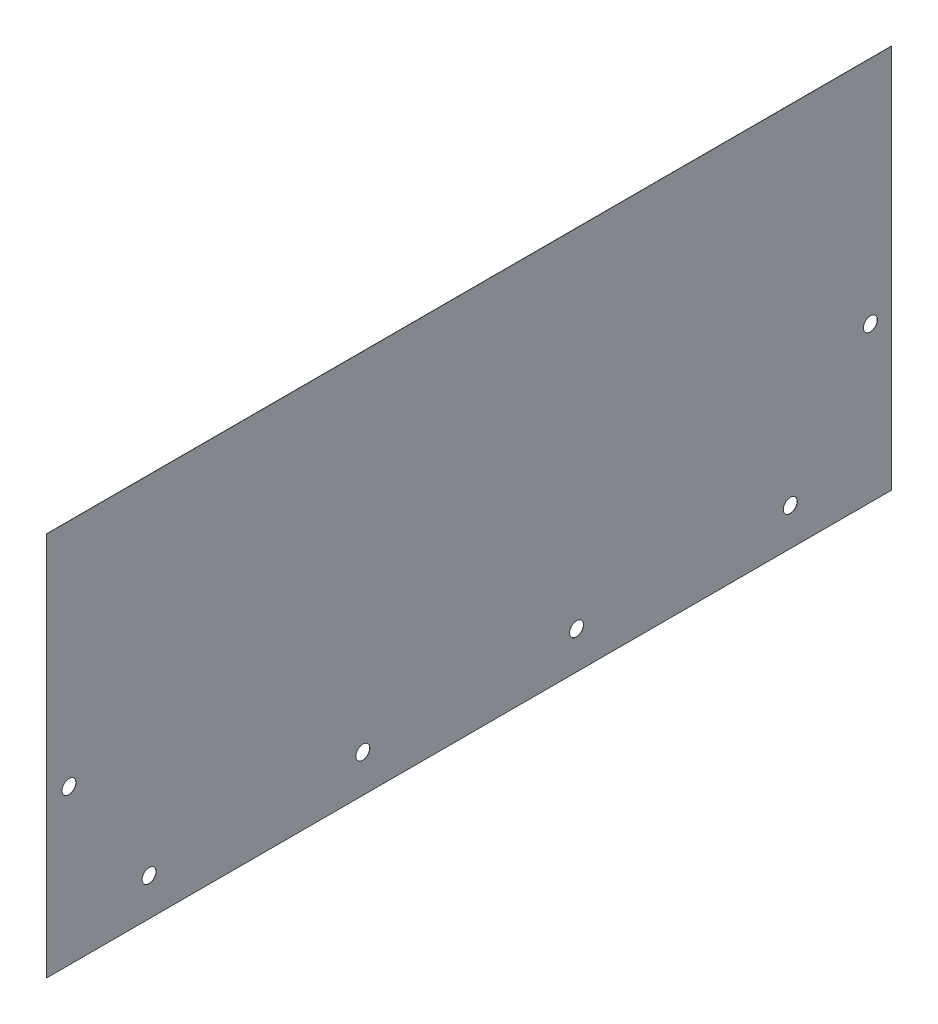
ISO-10303-21;
HEADER;
FILE_DESCRIPTION(('STEP AP214'),'2;1');
FILE_NAME('part.step','',(''),(''),'','','');
FILE_SCHEMA(('AUTOMOTIVE_DESIGN { 1 0 10303 214 1 1 1 1 }'));
ENDSEC;
DATA;
#1=APPLICATION_CONTEXT('core data for automotive mechanical design processes');
#2=APPLICATION_PROTOCOL_DEFINITION('international standard','automotive_design',2000,#1);
#3=PRODUCT_CONTEXT('',#1,'mechanical');
#4=PRODUCT('Part','Part','',(#3));
#5=PRODUCT_RELATED_PRODUCT_CATEGORY('part','',(#4));
#6=PRODUCT_DEFINITION_FORMATION('','',#4);
#7=PRODUCT_DEFINITION_CONTEXT('part definition',#1,'design');
#8=PRODUCT_DEFINITION('design','',#6,#7);
#9=PRODUCT_DEFINITION_SHAPE('','',#8);
#10=(LENGTH_UNIT() NAMED_UNIT(*) SI_UNIT(.MILLI.,.METRE.));
#11=(NAMED_UNIT(*) PLANE_ANGLE_UNIT() SI_UNIT($,.RADIAN.));
#12=(NAMED_UNIT(*) SI_UNIT($,.STERADIAN.) SOLID_ANGLE_UNIT());
#13=UNCERTAINTY_MEASURE_WITH_UNIT(LENGTH_MEASURE(1.E-05),#10,'distance_accuracy_value','');
#14=(GEOMETRIC_REPRESENTATION_CONTEXT(3) GLOBAL_UNCERTAINTY_ASSIGNED_CONTEXT((#13)) GLOBAL_UNIT_ASSIGNED_CONTEXT((#10,
#11,#12)) REPRESENTATION_CONTEXT('',''));
#15=CARTESIAN_POINT('',(0.,0.,0.));
#16=DIRECTION('',(0.,0.,1.));
#17=DIRECTION('',(1.,0.,0.));
#18=AXIS2_PLACEMENT_3D('',#15,#16,#17);
#19=CARTESIAN_POINT('',(0.,-312.9915,237.8583));
#20=DIRECTION('',(1.,0.,0.));
#21=DIRECTION('',(0.,0.,-1.));
#22=AXIS2_PLACEMENT_3D('',#19,#20,#21);
#23=CYLINDRICAL_SURFACE('',#22,4.16559999999999);
#24=CARTESIAN_POINT('',(0.,-312.9915,237.8583));
#25=DIRECTION('',(1.,0.,0.));
#26=DIRECTION('',(0.,0.,-1.));
#27=AXIS2_PLACEMENT_3D('',#24,#25,#26);
#28=CIRCLE('',#27,4.16559999999999);
#29=CARTESIAN_POINT('',(0.,-312.9915,233.6927));
#30=VERTEX_POINT('',#29);
#31=EDGE_CURVE('E40',#30,#30,#28,.T.);
#32=ORIENTED_EDGE('',*,*,#31,.F.);
#33=EDGE_LOOP('',(#32));
#34=FACE_BOUND('',#33,.T.);
#35=CARTESIAN_POINT('',(0.127,-312.9915,237.8583));
#36=DIRECTION('',(1.,0.,0.));
#37=DIRECTION('',(0.,0.,-1.));
#38=AXIS2_PLACEMENT_3D('',#35,#36,#37);
#39=CIRCLE('',#38,4.16559999999999);
#40=CARTESIAN_POINT('',(0.127,-312.9915,233.6927));
#41=VERTEX_POINT('',#40);
#42=EDGE_CURVE('E11',#41,#41,#39,.T.);
#43=ORIENTED_EDGE('',*,*,#42,.T.);
#44=EDGE_LOOP('',(#43));
#45=FACE_BOUND('',#44,.T.);
#46=ADVANCED_FACE('F33',(#34,#45),#23,.F.);
#47=CARTESIAN_POINT('',(0.,-312.9915,-238.5949));
#48=DIRECTION('',(1.,0.,0.));
#49=DIRECTION('',(0.,0.,-1.));
#50=AXIS2_PLACEMENT_3D('',#47,#48,#49);
#51=CYLINDRICAL_SURFACE('',#50,4.16559999999999);
#52=CARTESIAN_POINT('',(0.,-312.9915,-238.5949));
#53=DIRECTION('',(1.,0.,0.));
#54=DIRECTION('',(0.,0.,-1.));
#55=AXIS2_PLACEMENT_3D('',#52,#53,#54);
#56=CIRCLE('',#55,4.16559999999999);
#57=CARTESIAN_POINT('',(0.,-312.9915,-242.7605));
#58=VERTEX_POINT('',#57);
#59=EDGE_CURVE('E108',#58,#58,#56,.T.);
#60=ORIENTED_EDGE('',*,*,#59,.F.);
#61=EDGE_LOOP('',(#60));
#62=FACE_BOUND('',#61,.T.);
#63=CARTESIAN_POINT('',(0.127,-312.9915,-238.5949));
#64=DIRECTION('',(1.,0.,0.));
#65=DIRECTION('',(0.,0.,-1.));
#66=AXIS2_PLACEMENT_3D('',#63,#64,#65);
#67=CIRCLE('',#66,4.16559999999999);
#68=CARTESIAN_POINT('',(0.127,-312.9915,-242.7605));
#69=VERTEX_POINT('',#68);
#70=EDGE_CURVE('E111',#69,#69,#67,.T.);
#71=ORIENTED_EDGE('',*,*,#70,.T.);
#72=EDGE_LOOP('',(#71));
#73=FACE_BOUND('',#72,.T.);
#74=ADVANCED_FACE('F119',(#62,#73),#51,.F.);
#75=CARTESIAN_POINT('',(0.,-382.6383,190.2333));
#76=DIRECTION('',(1.,0.,0.));
#77=DIRECTION('',(0.,0.,-1.));
#78=AXIS2_PLACEMENT_3D('',#75,#76,#77);
#79=CYLINDRICAL_SURFACE('',#78,4.16559999999999);
#80=CARTESIAN_POINT('',(0.,-382.6383,190.2333));
#81=DIRECTION('',(1.,0.,0.));
#82=DIRECTION('',(0.,0.,-1.));
#83=AXIS2_PLACEMENT_3D('',#80,#81,#82);
#84=CIRCLE('',#83,4.16559999999999);
#85=CARTESIAN_POINT('',(0.,-382.6383,186.0677));
#86=VERTEX_POINT('',#85);
#87=EDGE_CURVE('E102',#86,#86,#84,.T.);
#88=ORIENTED_EDGE('',*,*,#87,.F.);
#89=EDGE_LOOP('',(#88));
#90=FACE_BOUND('',#89,.T.);
#91=CARTESIAN_POINT('',(0.127,-382.6383,190.2333));
#92=DIRECTION('',(1.,0.,0.));
#93=DIRECTION('',(0.,0.,-1.));
#94=AXIS2_PLACEMENT_3D('',#91,#92,#93);
#95=CIRCLE('',#94,4.16559999999999);
#96=CARTESIAN_POINT('',(0.127,-382.6383,186.0677));
#97=VERTEX_POINT('',#96);
#98=EDGE_CURVE('E105',#97,#97,#95,.T.);
#99=ORIENTED_EDGE('',*,*,#98,.T.);
#100=EDGE_LOOP('',(#99));
#101=FACE_BOUND('',#100,.T.);
#102=ADVANCED_FACE('F147',(#90,#101),#79,.F.);
#103=CARTESIAN_POINT('',(0.,-382.6383,63.1655666666665));
#104=DIRECTION('',(1.,0.,0.));
#105=DIRECTION('',(0.,0.,-1.));
#106=AXIS2_PLACEMENT_3D('',#103,#104,#105);
#107=CYLINDRICAL_SURFACE('',#106,4.16559999999999);
#108=CARTESIAN_POINT('',(0.,-382.6383,63.1655666666665));
#109=DIRECTION('',(1.,0.,0.));
#110=DIRECTION('',(0.,0.,-1.));
#111=AXIS2_PLACEMENT_3D('',#108,#109,#110);
#112=CIRCLE('',#111,4.16559999999999);
#113=CARTESIAN_POINT('',(0.,-382.6383,58.9999666666665));
#114=VERTEX_POINT('',#113);
#115=EDGE_CURVE('E96',#114,#114,#112,.T.);
#116=ORIENTED_EDGE('',*,*,#115,.F.);
#117=EDGE_LOOP('',(#116));
#118=FACE_BOUND('',#117,.T.);
#119=CARTESIAN_POINT('',(0.127,-382.6383,63.1655666666665));
#120=DIRECTION('',(1.,0.,0.));
#121=DIRECTION('',(0.,0.,-1.));
#122=AXIS2_PLACEMENT_3D('',#119,#120,#121);
#123=CIRCLE('',#122,4.16559999999999);
#124=CARTESIAN_POINT('',(0.127,-382.6383,58.9999666666665));
#125=VERTEX_POINT('',#124);
#126=EDGE_CURVE('E99',#125,#125,#123,.T.);
#127=ORIENTED_EDGE('',*,*,#126,.T.);
#128=EDGE_LOOP('',(#127));
#129=FACE_BOUND('',#128,.T.);
#130=ADVANCED_FACE('F143',(#118,#129),#107,.F.);
#131=CARTESIAN_POINT('',(0.127,-404.8633,251.1933));
#132=DIRECTION('',(0.,0.,-1.));
#133=DIRECTION('',(-1.,0.,0.));
#134=AXIS2_PLACEMENT_3D('',#131,#132,#133);
#135=PLANE('',#134);
#136=DIRECTION('',(0.,-1.,0.));
#137=VECTOR('',#136,1.);
#138=CARTESIAN_POINT('',(0.127,-404.8633,251.1933));
#139=LINE('',#138,#137);
#140=CARTESIAN_POINT('',(0.127,-176.2633,251.1933));
#141=VERTEX_POINT('',#140);
#142=CARTESIAN_POINT('',(0.127,-404.8633,251.1933));
#143=VERTEX_POINT('',#142);
#144=EDGE_CURVE('E90',#141,#143,#139,.T.);
#145=ORIENTED_EDGE('',*,*,#144,.F.);
#146=DIRECTION('',(-1.,0.,0.));
#147=VECTOR('',#146,1.);
#148=CARTESIAN_POINT('',(0.127,-176.2633,251.1933));
#149=LINE('',#148,#147);
#150=CARTESIAN_POINT('',(0.,-176.2633,251.1933));
#151=VERTEX_POINT('',#150);
#152=EDGE_CURVE('E252',#141,#151,#149,.T.);
#153=ORIENTED_EDGE('',*,*,#152,.T.);
#154=DIRECTION('',(0.,-1.,0.));
#155=VECTOR('',#154,1.);
#156=CARTESIAN_POINT('',(0.,-404.8633,251.1933));
#157=LINE('',#156,#155);
#158=CARTESIAN_POINT('',(0.,-404.8633,251.1933));
#159=VERTEX_POINT('',#158);
#160=EDGE_CURVE('E80',#151,#159,#157,.T.);
#161=ORIENTED_EDGE('',*,*,#160,.T.);
#162=DIRECTION('',(-1.,0.,0.));
#163=VECTOR('',#162,1.);
#164=CARTESIAN_POINT('',(0.127,-404.8633,251.1933));
#165=LINE('',#164,#163);
#166=EDGE_CURVE('E75',#143,#159,#165,.T.);
#167=ORIENTED_EDGE('',*,*,#166,.F.);
#168=EDGE_LOOP('',(#145,#153,#161,#167));
#169=FACE_BOUND('',#168,.T.);
#170=ADVANCED_FACE('F140',(#169),#135,.F.);
#171=CARTESIAN_POINT('',(0.127,-404.8633,-251.1933));
#172=DIRECTION('',(0.,1.,0.));
#173=DIRECTION('',(0.,0.,1.));
#174=AXIS2_PLACEMENT_3D('',#171,#172,#173);
#175=PLANE('',#174);
#176=DIRECTION('',(0.,0.,-1.));
#177=VECTOR('',#176,1.);
#178=CARTESIAN_POINT('',(0.,-404.8633,-251.1933));
#179=LINE('',#178,#177);
#180=CARTESIAN_POINT('',(0.,-404.8633,-251.1933));
#181=VERTEX_POINT('',#180);
#182=EDGE_CURVE('E69',#159,#181,#179,.T.);
#183=ORIENTED_EDGE('',*,*,#182,.T.);
#184=DIRECTION('',(-1.,0.,0.));
#185=VECTOR('',#184,1.);
#186=CARTESIAN_POINT('',(0.127,-404.8633,-251.1933));
#187=LINE('',#186,#185);
#188=CARTESIAN_POINT('',(0.127,-404.8633,-251.1933));
#189=VERTEX_POINT('',#188);
#190=EDGE_CURVE('E72',#189,#181,#187,.T.);
#191=ORIENTED_EDGE('',*,*,#190,.F.);
#192=DIRECTION('',(0.,0.,-1.));
#193=VECTOR('',#192,1.);
#194=CARTESIAN_POINT('',(0.127,-404.8633,-251.1933));
#195=LINE('',#194,#193);
#196=EDGE_CURVE('E56',#143,#189,#195,.T.);
#197=ORIENTED_EDGE('',*,*,#196,.F.);
#198=ORIENTED_EDGE('',*,*,#166,.T.);
#199=EDGE_LOOP('',(#183,#191,#197,#198));
#200=FACE_BOUND('',#199,.T.);
#201=ADVANCED_FACE('F71',(#200),#175,.F.);
#202=CARTESIAN_POINT('',(0.127,-404.8633,-251.1933));
#203=DIRECTION('',(0.,0.,1.));
#204=DIRECTION('',(1.,0.,0.));
#205=AXIS2_PLACEMENT_3D('',#202,#203,#204);
#206=PLANE('',#205);
#207=DIRECTION('',(0.,1.,0.));
#208=VECTOR('',#207,1.);
#209=CARTESIAN_POINT('',(0.,-404.8633,-251.1933));
#210=LINE('',#209,#208);
#211=CARTESIAN_POINT('',(0.,-176.2633,-251.1933));
#212=VERTEX_POINT('',#211);
#213=EDGE_CURVE('E79',#181,#212,#210,.T.);
#214=ORIENTED_EDGE('',*,*,#213,.T.);
#215=DIRECTION('',(-1.,0.,0.));
#216=VECTOR('',#215,1.);
#217=CARTESIAN_POINT('',(0.127,-176.2633,-251.1933));
#218=LINE('',#217,#216);
#219=CARTESIAN_POINT('',(0.127,-176.2633,-251.1933));
#220=VERTEX_POINT('',#219);
#221=EDGE_CURVE('E47',#220,#212,#218,.T.);
#222=ORIENTED_EDGE('',*,*,#221,.F.);
#223=DIRECTION('',(0.,1.,0.));
#224=VECTOR('',#223,1.);
#225=CARTESIAN_POINT('',(0.127,-404.8633,-251.1933));
#226=LINE('',#225,#224);
#227=EDGE_CURVE('E85',#189,#220,#226,.T.);
#228=ORIENTED_EDGE('',*,*,#227,.F.);
#229=ORIENTED_EDGE('',*,*,#190,.T.);
#230=EDGE_LOOP('',(#214,#222,#228,#229));
#231=FACE_BOUND('',#230,.T.);
#232=ADVANCED_FACE('F84',(#231),#206,.F.);
#233=CARTESIAN_POINT('',(0.127,0.,0.));
#234=DIRECTION('',(1.,0.,0.));
#235=DIRECTION('',(0.,0.,-1.));
#236=AXIS2_PLACEMENT_3D('',#233,#234,#235);
#237=PLANE('',#236);
#238=DIRECTION('',(0.,0.,1.));
#239=VECTOR('',#238,1.);
#240=CARTESIAN_POINT('',(0.127,-176.2633,-251.1933));
#241=LINE('',#240,#239);
#242=EDGE_CURVE('E256',#220,#141,#241,.T.);
#243=ORIENTED_EDGE('',*,*,#242,.T.);
#244=ORIENTED_EDGE('',*,*,#144,.T.);
#245=ORIENTED_EDGE('',*,*,#196,.T.);
#246=ORIENTED_EDGE('',*,*,#227,.T.);
#247=EDGE_LOOP('',(#243,#244,#245,#246));
#248=FACE_BOUND('',#247,.T.);
#249=CARTESIAN_POINT('',(0.127,-382.6383,-63.9021666666668));
#250=DIRECTION('',(1.,0.,0.));
#251=DIRECTION('',(0.,0.,-1.));
#252=AXIS2_PLACEMENT_3D('',#249,#250,#251);
#253=CIRCLE('',#252,4.16559999999999);
#254=CARTESIAN_POINT('',(0.127,-382.6383,-68.0677666666668));
#255=VERTEX_POINT('',#254);
#256=EDGE_CURVE('E240',#255,#255,#253,.T.);
#257=ORIENTED_EDGE('',*,*,#256,.F.);
#258=EDGE_LOOP('',(#257));
#259=FACE_BOUND('',#258,.T.);
#260=CARTESIAN_POINT('',(0.127,-382.6383,-190.9699));
#261=DIRECTION('',(1.,0.,0.));
#262=DIRECTION('',(0.,0.,-1.));
#263=AXIS2_PLACEMENT_3D('',#260,#261,#262);
#264=CIRCLE('',#263,4.16559999999999);
#265=CARTESIAN_POINT('',(0.127,-382.6383,-195.1355));
#266=VERTEX_POINT('',#265);
#267=EDGE_CURVE('E238',#266,#266,#264,.T.);
#268=ORIENTED_EDGE('',*,*,#267,.F.);
#269=EDGE_LOOP('',(#268));
#270=FACE_BOUND('',#269,.T.);
#271=ORIENTED_EDGE('',*,*,#126,.F.);
#272=EDGE_LOOP('',(#271));
#273=FACE_BOUND('',#272,.T.);
#274=ORIENTED_EDGE('',*,*,#98,.F.);
#275=EDGE_LOOP('',(#274));
#276=FACE_BOUND('',#275,.T.);
#277=ORIENTED_EDGE('',*,*,#70,.F.);
#278=EDGE_LOOP('',(#277));
#279=FACE_BOUND('',#278,.T.);
#280=ORIENTED_EDGE('',*,*,#42,.F.);
#281=EDGE_LOOP('',(#280));
#282=FACE_BOUND('',#281,.T.);
#283=ADVANCED_FACE('F122',(#248,#259,#270,#273,#276,#279,#282),#237,.T.);
#284=CARTESIAN_POINT('',(0.,0.,0.));
#285=DIRECTION('',(1.,0.,0.));
#286=DIRECTION('',(0.,0.,-1.));
#287=AXIS2_PLACEMENT_3D('',#284,#285,#286);
#288=PLANE('',#287);
#289=CARTESIAN_POINT('',(0.,-382.6383,-63.9021666666668));
#290=DIRECTION('',(1.,0.,0.));
#291=DIRECTION('',(0.,0.,-1.));
#292=AXIS2_PLACEMENT_3D('',#289,#290,#291);
#293=CIRCLE('',#292,4.16559999999999);
#294=CARTESIAN_POINT('',(0.,-382.6383,-68.0677666666668));
#295=VERTEX_POINT('',#294);
#296=EDGE_CURVE('E244',#295,#295,#293,.T.);
#297=ORIENTED_EDGE('',*,*,#296,.T.);
#298=EDGE_LOOP('',(#297));
#299=FACE_BOUND('',#298,.T.);
#300=CARTESIAN_POINT('',(0.,-382.6383,-190.9699));
#301=DIRECTION('',(1.,0.,0.));
#302=DIRECTION('',(0.,0.,-1.));
#303=AXIS2_PLACEMENT_3D('',#300,#301,#302);
#304=CIRCLE('',#303,4.16559999999999);
#305=CARTESIAN_POINT('',(0.,-382.6383,-195.1355));
#306=VERTEX_POINT('',#305);
#307=EDGE_CURVE('E235',#306,#306,#304,.T.);
#308=ORIENTED_EDGE('',*,*,#307,.T.);
#309=EDGE_LOOP('',(#308));
#310=FACE_BOUND('',#309,.T.);
#311=ORIENTED_EDGE('',*,*,#160,.F.);
#312=DIRECTION('',(0.,0.,1.));
#313=VECTOR('',#312,1.);
#314=CARTESIAN_POINT('',(0.,-176.2633,-251.1933));
#315=LINE('',#314,#313);
#316=EDGE_CURVE('E89',#212,#151,#315,.T.);
#317=ORIENTED_EDGE('',*,*,#316,.F.);
#318=ORIENTED_EDGE('',*,*,#213,.F.);
#319=ORIENTED_EDGE('',*,*,#182,.F.);
#320=EDGE_LOOP('',(#311,#317,#318,#319));
#321=FACE_BOUND('',#320,.T.);
#322=ORIENTED_EDGE('',*,*,#115,.T.);
#323=EDGE_LOOP('',(#322));
#324=FACE_BOUND('',#323,.T.);
#325=ORIENTED_EDGE('',*,*,#87,.T.);
#326=EDGE_LOOP('',(#325));
#327=FACE_BOUND('',#326,.T.);
#328=ORIENTED_EDGE('',*,*,#59,.T.);
#329=EDGE_LOOP('',(#328));
#330=FACE_BOUND('',#329,.T.);
#331=ORIENTED_EDGE('',*,*,#31,.T.);
#332=EDGE_LOOP('',(#331));
#333=FACE_BOUND('',#332,.T.);
#334=ADVANCED_FACE('F87',(#299,#310,#321,#324,#327,#330,#333),#288,.F.);
#335=CARTESIAN_POINT('',(0.,-382.6383,-190.9699));
#336=DIRECTION('',(1.,0.,0.));
#337=DIRECTION('',(0.,0.,-1.));
#338=AXIS2_PLACEMENT_3D('',#335,#336,#337);
#339=CYLINDRICAL_SURFACE('',#338,4.16559999999999);
#340=ORIENTED_EDGE('',*,*,#307,.F.);
#341=EDGE_LOOP('',(#340));
#342=FACE_BOUND('',#341,.T.);
#343=ORIENTED_EDGE('',*,*,#267,.T.);
#344=EDGE_LOOP('',(#343));
#345=FACE_BOUND('',#344,.T.);
#346=ADVANCED_FACE('F129',(#342,#345),#339,.F.);
#347=CARTESIAN_POINT('',(0.,-382.6383,-63.9021666666668));
#348=DIRECTION('',(1.,0.,0.));
#349=DIRECTION('',(0.,0.,-1.));
#350=AXIS2_PLACEMENT_3D('',#347,#348,#349);
#351=CYLINDRICAL_SURFACE('',#350,4.16559999999999);
#352=ORIENTED_EDGE('',*,*,#296,.F.);
#353=EDGE_LOOP('',(#352));
#354=FACE_BOUND('',#353,.T.);
#355=ORIENTED_EDGE('',*,*,#256,.T.);
#356=EDGE_LOOP('',(#355));
#357=FACE_BOUND('',#356,.T.);
#358=ADVANCED_FACE('F205',(#354,#357),#351,.F.);
#359=CARTESIAN_POINT('',(0.127,-176.2633,-251.1933));
#360=DIRECTION('',(0.,-1.,0.));
#361=DIRECTION('',(0.,0.,-1.));
#362=AXIS2_PLACEMENT_3D('',#359,#360,#361);
#363=PLANE('',#362);
#364=ORIENTED_EDGE('',*,*,#316,.T.);
#365=ORIENTED_EDGE('',*,*,#152,.F.);
#366=ORIENTED_EDGE('',*,*,#242,.F.);
#367=ORIENTED_EDGE('',*,*,#221,.T.);
#368=EDGE_LOOP('',(#364,#365,#366,#367));
#369=FACE_BOUND('',#368,.T.);
#370=ADVANCED_FACE('F201',(#369),#363,.F.);
#371=CLOSED_SHELL('',(#46,#74,#102,#130,#170,#201,#232,#283,#334,#346,#358,#370));
#372=MANIFOLD_SOLID_BREP('B2',#371);
#373=ADVANCED_BREP_SHAPE_REPRESENTATION('',(#18,#372),#14);
#374=SHAPE_DEFINITION_REPRESENTATION(#9,#373);
ENDSEC;
END-ISO-10303-21;
